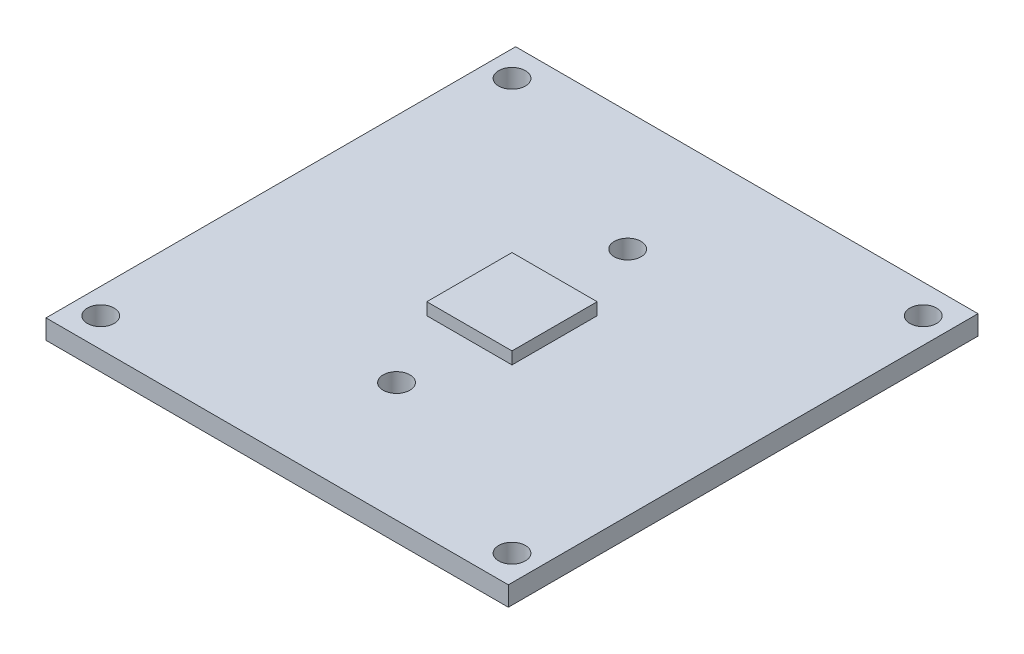
ISO-10303-21;
HEADER;
FILE_DESCRIPTION(('STEP AP214'),'2;1');
FILE_NAME('part.step','',(''),(''),'','','');
FILE_SCHEMA(('AUTOMOTIVE_DESIGN { 1 0 10303 214 1 1 1 1 }'));
ENDSEC;
DATA;
#1=APPLICATION_CONTEXT('core data for automotive mechanical design processes');
#2=APPLICATION_PROTOCOL_DEFINITION('international standard','automotive_design',2000,#1);
#3=PRODUCT_CONTEXT('',#1,'mechanical');
#4=PRODUCT('Part','Part','',(#3));
#5=PRODUCT_RELATED_PRODUCT_CATEGORY('part','',(#4));
#6=PRODUCT_DEFINITION_FORMATION('','',#4);
#7=PRODUCT_DEFINITION_CONTEXT('part definition',#1,'design');
#8=PRODUCT_DEFINITION('design','',#6,#7);
#9=PRODUCT_DEFINITION_SHAPE('','',#8);
#10=(LENGTH_UNIT() NAMED_UNIT(*) SI_UNIT(.MILLI.,.METRE.));
#11=(NAMED_UNIT(*) PLANE_ANGLE_UNIT() SI_UNIT($,.RADIAN.));
#12=(NAMED_UNIT(*) SI_UNIT($,.STERADIAN.) SOLID_ANGLE_UNIT());
#13=UNCERTAINTY_MEASURE_WITH_UNIT(LENGTH_MEASURE(1.E-05),#10,'distance_accuracy_value','');
#14=(GEOMETRIC_REPRESENTATION_CONTEXT(3) GLOBAL_UNCERTAINTY_ASSIGNED_CONTEXT((#13)) GLOBAL_UNIT_ASSIGNED_CONTEXT((#10,
#11,#12)) REPRESENTATION_CONTEXT('',''));
#15=CARTESIAN_POINT('',(0.,0.,0.));
#16=DIRECTION('',(0.,0.,1.));
#17=DIRECTION('',(1.,0.,0.));
#18=AXIS2_PLACEMENT_3D('',#15,#16,#17);
#19=CARTESIAN_POINT('',(0.,1.6,0.));
#20=DIRECTION('',(0.,1.,0.));
#21=DIRECTION('',(0.,0.,1.));
#22=AXIS2_PLACEMENT_3D('',#19,#20,#21);
#23=PLANE('',#22);
#24=CARTESIAN_POINT('',(16.9,1.6,-16.9));
#25=DIRECTION('',(0.,1.,0.));
#26=DIRECTION('',(0.,0.,1.));
#27=AXIS2_PLACEMENT_3D('',#24,#25,#26);
#28=CIRCLE('',#27,1.1);
#29=CARTESIAN_POINT('',(16.9,1.6,-15.8));
#30=VERTEX_POINT('',#29);
#31=EDGE_CURVE('E193',#30,#30,#28,.F.);
#32=ORIENTED_EDGE('',*,*,#31,.T.);
#33=EDGE_LOOP('',(#32));
#34=FACE_BOUND('',#33,.T.);
#35=CARTESIAN_POINT('',(-16.9,1.6,-16.9));
#36=DIRECTION('',(0.,1.,0.));
#37=DIRECTION('',(0.,0.,1.));
#38=AXIS2_PLACEMENT_3D('',#35,#36,#37);
#39=CIRCLE('',#38,1.1);
#40=CARTESIAN_POINT('',(-16.9,1.6,-15.8));
#41=VERTEX_POINT('',#40);
#42=EDGE_CURVE('E196',#41,#41,#39,.T.);
#43=ORIENTED_EDGE('',*,*,#42,.F.);
#44=EDGE_LOOP('',(#43));
#45=FACE_BOUND('',#44,.T.);
#46=DIRECTION('',(1.,0.,0.));
#47=VECTOR('',#46,1.);
#48=CARTESIAN_POINT('',(0.,1.6,19.3));
#49=LINE('',#48,#47);
#50=CARTESIAN_POINT('',(-19.,1.6,19.3));
#51=VERTEX_POINT('',#50);
#52=CARTESIAN_POINT('',(19.,1.6,19.3));
#53=VERTEX_POINT('',#52);
#54=EDGE_CURVE('E200',#51,#53,#49,.T.);
#55=ORIENTED_EDGE('',*,*,#54,.T.);
#56=DIRECTION('',(0.,0.,-1.));
#57=VECTOR('',#56,1.);
#58=CARTESIAN_POINT('',(19.,1.6,0.));
#59=LINE('',#58,#57);
#60=CARTESIAN_POINT('',(19.,1.6,-19.3));
#61=VERTEX_POINT('',#60);
#62=EDGE_CURVE('E203',#53,#61,#59,.T.);
#63=ORIENTED_EDGE('',*,*,#62,.T.);
#64=DIRECTION('',(1.,0.,0.));
#65=VECTOR('',#64,1.);
#66=CARTESIAN_POINT('',(0.,1.6,-19.3));
#67=LINE('',#66,#65);
#68=CARTESIAN_POINT('',(-19.,1.6,-19.3));
#69=VERTEX_POINT('',#68);
#70=EDGE_CURVE('E205',#69,#61,#67,.T.);
#71=ORIENTED_EDGE('',*,*,#70,.F.);
#72=DIRECTION('',(0.,0.,-1.));
#73=VECTOR('',#72,1.);
#74=CARTESIAN_POINT('',(-19.,1.6,0.));
#75=LINE('',#74,#73);
#76=EDGE_CURVE('E208',#51,#69,#75,.T.);
#77=ORIENTED_EDGE('',*,*,#76,.F.);
#78=EDGE_LOOP('',(#55,#63,#71,#77));
#79=FACE_BOUND('',#78,.T.);
#80=CARTESIAN_POINT('',(16.9,1.6,16.9));
#81=DIRECTION('',(0.,1.,0.));
#82=DIRECTION('',(0.,0.,1.));
#83=AXIS2_PLACEMENT_3D('',#80,#81,#82);
#84=CIRCLE('',#83,1.1);
#85=CARTESIAN_POINT('',(16.9,1.6,18.));
#86=VERTEX_POINT('',#85);
#87=EDGE_CURVE('E211',#86,#86,#84,.T.);
#88=ORIENTED_EDGE('',*,*,#87,.F.);
#89=EDGE_LOOP('',(#88));
#90=FACE_BOUND('',#89,.T.);
#91=CARTESIAN_POINT('',(-16.9,1.6,16.9));
#92=DIRECTION('',(0.,1.,0.));
#93=DIRECTION('',(0.,0.,1.));
#94=AXIS2_PLACEMENT_3D('',#91,#92,#93);
#95=CIRCLE('',#94,1.1);
#96=CARTESIAN_POINT('',(-16.9,1.6,18.));
#97=VERTEX_POINT('',#96);
#98=EDGE_CURVE('E214',#97,#97,#95,.F.);
#99=ORIENTED_EDGE('',*,*,#98,.T.);
#100=EDGE_LOOP('',(#99));
#101=FACE_BOUND('',#100,.T.);
#102=CARTESIAN_POINT('',(0.00814078074622268,1.6,-9.5));
#103=DIRECTION('',(0.,1.,0.));
#104=DIRECTION('',(0.,0.,1.));
#105=AXIS2_PLACEMENT_3D('',#102,#103,#104);
#106=CIRCLE('',#105,1.1);
#107=CARTESIAN_POINT('',(0.00814078074622268,1.6,-8.4));
#108=VERTEX_POINT('',#107);
#109=EDGE_CURVE('E217',#108,#108,#106,.T.);
#110=ORIENTED_EDGE('',*,*,#109,.F.);
#111=EDGE_LOOP('',(#110));
#112=FACE_BOUND('',#111,.T.);
#113=CARTESIAN_POINT('',(0.00814078074622268,1.6,9.5));
#114=DIRECTION('',(0.,1.,0.));
#115=DIRECTION('',(0.,0.,1.));
#116=AXIS2_PLACEMENT_3D('',#113,#114,#115);
#117=CIRCLE('',#116,1.1);
#118=CARTESIAN_POINT('',(0.00814078074622268,1.6,10.6));
#119=VERTEX_POINT('',#118);
#120=EDGE_CURVE('E220',#119,#119,#117,.F.);
#121=ORIENTED_EDGE('',*,*,#120,.T.);
#122=EDGE_LOOP('',(#121));
#123=FACE_BOUND('',#122,.T.);
#124=DIRECTION('',(-1.,0.,0.));
#125=VECTOR('',#124,1.);
#126=CARTESIAN_POINT('',(-3.5,1.6,-3.5));
#127=LINE('',#126,#125);
#128=CARTESIAN_POINT('',(3.5,1.6,-3.5));
#129=VERTEX_POINT('',#128);
#130=CARTESIAN_POINT('',(-3.5,1.6,-3.5));
#131=VERTEX_POINT('',#130);
#132=EDGE_CURVE('E564',#129,#131,#127,.T.);
#133=ORIENTED_EDGE('',*,*,#132,.F.);
#134=DIRECTION('',(0.,0.,-1.));
#135=VECTOR('',#134,1.);
#136=CARTESIAN_POINT('',(3.5,1.6,3.5));
#137=LINE('',#136,#135);
#138=CARTESIAN_POINT('',(3.5,1.6,3.5));
#139=VERTEX_POINT('',#138);
#140=EDGE_CURVE('E151',#139,#129,#137,.T.);
#141=ORIENTED_EDGE('',*,*,#140,.F.);
#142=DIRECTION('',(1.,0.,0.));
#143=VECTOR('',#142,1.);
#144=CARTESIAN_POINT('',(-3.5,1.6,3.5));
#145=LINE('',#144,#143);
#146=CARTESIAN_POINT('',(-3.5,1.6,3.5));
#147=VERTEX_POINT('',#146);
#148=EDGE_CURVE('E147',#147,#139,#145,.T.);
#149=ORIENTED_EDGE('',*,*,#148,.F.);
#150=DIRECTION('',(0.,0.,1.));
#151=VECTOR('',#150,1.);
#152=CARTESIAN_POINT('',(-3.5,1.6,3.5));
#153=LINE('',#152,#151);
#154=EDGE_CURVE('E566',#131,#147,#153,.T.);
#155=ORIENTED_EDGE('',*,*,#154,.F.);
#156=EDGE_LOOP('',(#133,#141,#149,#155));
#157=FACE_BOUND('',#156,.T.);
#158=ADVANCED_FACE('F38',(#34,#45,#79,#90,#101,#112,#123,#157),#23,.T.);
#159=CARTESIAN_POINT('',(0.,0.,0.));
#160=DIRECTION('',(0.,1.,0.));
#161=DIRECTION('',(0.,0.,1.));
#162=AXIS2_PLACEMENT_3D('',#159,#160,#161);
#163=PLANE('',#162);
#164=CARTESIAN_POINT('',(0.00814078074622268,0.,9.5));
#165=DIRECTION('',(0.,1.,0.));
#166=DIRECTION('',(0.,0.,1.));
#167=AXIS2_PLACEMENT_3D('',#164,#165,#166);
#168=CIRCLE('',#167,1.1);
#169=CARTESIAN_POINT('',(0.00814078074622268,0.,10.6));
#170=VERTEX_POINT('',#169);
#171=EDGE_CURVE('E197',#170,#170,#168,.F.);
#172=ORIENTED_EDGE('',*,*,#171,.F.);
#173=EDGE_LOOP('',(#172));
#174=FACE_BOUND('',#173,.T.);
#175=CARTESIAN_POINT('',(0.00814078074622268,0.,9.5));
#176=DIRECTION('',(0.,1.,0.));
#177=DIRECTION('',(0.,0.,1.));
#178=AXIS2_PLACEMENT_3D('',#175,#176,#177);
#179=CIRCLE('',#178,2.);
#180=CARTESIAN_POINT('',(0.00814078074622268,0.,11.5));
#181=VERTEX_POINT('',#180);
#182=EDGE_CURVE('E11',#181,#181,#179,.T.);
#183=ORIENTED_EDGE('',*,*,#182,.F.);
#184=EDGE_LOOP('',(#183));
#185=FACE_BOUND('',#184,.T.);
#186=ADVANCED_FACE('F267',(#174,#185),#163,.F.);
#187=CARTESIAN_POINT('',(0.00814078074622268,0.,-9.5));
#188=DIRECTION('',(0.,1.,0.));
#189=DIRECTION('',(0.,0.,1.));
#190=AXIS2_PLACEMENT_3D('',#187,#188,#189);
#191=CIRCLE('',#190,1.1);
#192=CARTESIAN_POINT('',(0.00814078074622268,0.,-8.4));
#193=VERTEX_POINT('',#192);
#194=EDGE_CURVE('E247',#193,#193,#191,.T.);
#195=ORIENTED_EDGE('',*,*,#194,.T.);
#196=EDGE_LOOP('',(#195));
#197=FACE_BOUND('',#196,.T.);
#198=CARTESIAN_POINT('',(0.00814078074622268,0.,-9.5));
#199=DIRECTION('',(0.,1.,0.));
#200=DIRECTION('',(0.,0.,1.));
#201=AXIS2_PLACEMENT_3D('',#198,#199,#200);
#202=CIRCLE('',#201,2.);
#203=CARTESIAN_POINT('',(0.00814078074622268,0.,-7.5));
#204=VERTEX_POINT('',#203);
#205=EDGE_CURVE('E46',#204,#204,#202,.T.);
#206=ORIENTED_EDGE('',*,*,#205,.F.);
#207=EDGE_LOOP('',(#206));
#208=FACE_BOUND('',#207,.T.);
#209=ADVANCED_FACE('F264',(#197,#208),#163,.F.);
#210=CARTESIAN_POINT('',(0.,1.6,19.3));
#211=DIRECTION('',(0.,0.,-1.));
#212=DIRECTION('',(-1.,0.,0.));
#213=AXIS2_PLACEMENT_3D('',#210,#211,#212);
#214=PLANE('',#213);
#215=DIRECTION('',(1.,0.,0.));
#216=VECTOR('',#215,1.);
#217=CARTESIAN_POINT('',(0.,0.,19.3));
#218=LINE('',#217,#216);
#219=CARTESIAN_POINT('',(-19.,0.,19.3));
#220=VERTEX_POINT('',#219);
#221=CARTESIAN_POINT('',(19.,0.,19.3));
#222=VERTEX_POINT('',#221);
#223=EDGE_CURVE('E229',#220,#222,#218,.T.);
#224=ORIENTED_EDGE('',*,*,#223,.T.);
#225=DIRECTION('',(0.,-1.,0.));
#226=VECTOR('',#225,1.);
#227=CARTESIAN_POINT('',(19.,1.6,19.3));
#228=LINE('',#227,#226);
#229=EDGE_CURVE('E257',#53,#222,#228,.T.);
#230=ORIENTED_EDGE('',*,*,#229,.F.);
#231=ORIENTED_EDGE('',*,*,#54,.F.);
#232=DIRECTION('',(0.,-1.,0.));
#233=VECTOR('',#232,1.);
#234=CARTESIAN_POINT('',(-19.,1.6,19.3));
#235=LINE('',#234,#233);
#236=EDGE_CURVE('E223',#51,#220,#235,.T.);
#237=ORIENTED_EDGE('',*,*,#236,.T.);
#238=EDGE_LOOP('',(#224,#230,#231,#237));
#239=FACE_BOUND('',#238,.T.);
#240=ADVANCED_FACE('F266',(#239),#214,.F.);
#241=CARTESIAN_POINT('',(19.,1.6,0.));
#242=DIRECTION('',(-1.,0.,0.));
#243=DIRECTION('',(0.,0.,1.));
#244=AXIS2_PLACEMENT_3D('',#241,#242,#243);
#245=PLANE('',#244);
#246=DIRECTION('',(0.,0.,-1.));
#247=VECTOR('',#246,1.);
#248=CARTESIAN_POINT('',(19.,0.,0.));
#249=LINE('',#248,#247);
#250=CARTESIAN_POINT('',(19.,0.,-19.3));
#251=VERTEX_POINT('',#250);
#252=EDGE_CURVE('E232',#222,#251,#249,.T.);
#253=ORIENTED_EDGE('',*,*,#252,.T.);
#254=DIRECTION('',(0.,-1.,0.));
#255=VECTOR('',#254,1.);
#256=CARTESIAN_POINT('',(19.,1.6,-19.3));
#257=LINE('',#256,#255);
#258=EDGE_CURVE('E255',#61,#251,#257,.T.);
#259=ORIENTED_EDGE('',*,*,#258,.F.);
#260=ORIENTED_EDGE('',*,*,#62,.F.);
#261=ORIENTED_EDGE('',*,*,#229,.T.);
#262=EDGE_LOOP('',(#253,#259,#260,#261));
#263=FACE_BOUND('',#262,.T.);
#264=ADVANCED_FACE('F275',(#263),#245,.F.);
#265=CARTESIAN_POINT('',(0.,1.6,-19.3));
#266=DIRECTION('',(0.,0.,-1.));
#267=DIRECTION('',(-1.,0.,0.));
#268=AXIS2_PLACEMENT_3D('',#265,#266,#267);
#269=PLANE('',#268);
#270=DIRECTION('',(1.,0.,0.));
#271=VECTOR('',#270,1.);
#272=CARTESIAN_POINT('',(0.,0.,-19.3));
#273=LINE('',#272,#271);
#274=CARTESIAN_POINT('',(-19.,0.,-19.3));
#275=VERTEX_POINT('',#274);
#276=EDGE_CURVE('E235',#275,#251,#273,.T.);
#277=ORIENTED_EDGE('',*,*,#276,.F.);
#278=DIRECTION('',(0.,-1.,0.));
#279=VECTOR('',#278,1.);
#280=CARTESIAN_POINT('',(-19.,1.6,-19.3));
#281=LINE('',#280,#279);
#282=EDGE_CURVE('E253',#69,#275,#281,.T.);
#283=ORIENTED_EDGE('',*,*,#282,.F.);
#284=ORIENTED_EDGE('',*,*,#70,.T.);
#285=ORIENTED_EDGE('',*,*,#258,.T.);
#286=EDGE_LOOP('',(#277,#283,#284,#285));
#287=FACE_BOUND('',#286,.T.);
#288=ADVANCED_FACE('F429',(#287),#269,.T.);
#289=CARTESIAN_POINT('',(0.00814078074622268,1.6,-9.5));
#290=DIRECTION('',(0.,-1.,0.));
#291=DIRECTION('',(0.,0.,-1.));
#292=AXIS2_PLACEMENT_3D('',#289,#290,#291);
#293=CYLINDRICAL_SURFACE('',#292,1.1);
#294=ORIENTED_EDGE('',*,*,#109,.T.);
#295=EDGE_LOOP('',(#294));
#296=FACE_BOUND('',#295,.T.);
#297=ORIENTED_EDGE('',*,*,#194,.F.);
#298=EDGE_LOOP('',(#297));
#299=FACE_BOUND('',#298,.T.);
#300=ADVANCED_FACE('F421',(#296,#299),#293,.F.);
#301=CARTESIAN_POINT('',(-16.9,1.6,16.9));
#302=DIRECTION('',(0.,-1.,0.));
#303=DIRECTION('',(0.,0.,-1.));
#304=AXIS2_PLACEMENT_3D('',#301,#302,#303);
#305=CYLINDRICAL_SURFACE('',#304,1.1);
#306=ORIENTED_EDGE('',*,*,#98,.F.);
#307=EDGE_LOOP('',(#306));
#308=FACE_BOUND('',#307,.T.);
#309=CARTESIAN_POINT('',(-16.9,0.,16.9));
#310=DIRECTION('',(0.,1.,0.));
#311=DIRECTION('',(0.,0.,1.));
#312=AXIS2_PLACEMENT_3D('',#309,#310,#311);
#313=CIRCLE('',#312,1.1);
#314=CARTESIAN_POINT('',(-16.9,0.,18.));
#315=VERTEX_POINT('',#314);
#316=EDGE_CURVE('E244',#315,#315,#313,.F.);
#317=ORIENTED_EDGE('',*,*,#316,.T.);
#318=EDGE_LOOP('',(#317));
#319=FACE_BOUND('',#318,.T.);
#320=ADVANCED_FACE('F413',(#308,#319),#305,.F.);
#321=CARTESIAN_POINT('',(16.9,1.6,16.9));
#322=DIRECTION('',(0.,-1.,0.));
#323=DIRECTION('',(0.,0.,-1.));
#324=AXIS2_PLACEMENT_3D('',#321,#322,#323);
#325=CYLINDRICAL_SURFACE('',#324,1.1);
#326=ORIENTED_EDGE('',*,*,#87,.T.);
#327=EDGE_LOOP('',(#326));
#328=FACE_BOUND('',#327,.T.);
#329=CARTESIAN_POINT('',(16.9,0.,16.9));
#330=DIRECTION('',(0.,1.,0.));
#331=DIRECTION('',(0.,0.,1.));
#332=AXIS2_PLACEMENT_3D('',#329,#330,#331);
#333=CIRCLE('',#332,1.1);
#334=CARTESIAN_POINT('',(16.9,0.,18.));
#335=VERTEX_POINT('',#334);
#336=EDGE_CURVE('E241',#335,#335,#333,.T.);
#337=ORIENTED_EDGE('',*,*,#336,.F.);
#338=EDGE_LOOP('',(#337));
#339=FACE_BOUND('',#338,.T.);
#340=ADVANCED_FACE('F405',(#328,#339),#325,.F.);
#341=CARTESIAN_POINT('',(-19.,1.6,0.));
#342=DIRECTION('',(-1.,0.,0.));
#343=DIRECTION('',(0.,0.,1.));
#344=AXIS2_PLACEMENT_3D('',#341,#342,#343);
#345=PLANE('',#344);
#346=DIRECTION('',(0.,0.,-1.));
#347=VECTOR('',#346,1.);
#348=CARTESIAN_POINT('',(-19.,0.,0.));
#349=LINE('',#348,#347);
#350=EDGE_CURVE('E238',#220,#275,#349,.T.);
#351=ORIENTED_EDGE('',*,*,#350,.F.);
#352=ORIENTED_EDGE('',*,*,#236,.F.);
#353=ORIENTED_EDGE('',*,*,#76,.T.);
#354=ORIENTED_EDGE('',*,*,#282,.T.);
#355=EDGE_LOOP('',(#351,#352,#353,#354));
#356=FACE_BOUND('',#355,.T.);
#357=ADVANCED_FACE('F398',(#356),#345,.T.);
#358=CARTESIAN_POINT('',(-16.9,1.6,-16.9));
#359=DIRECTION('',(0.,-1.,0.));
#360=DIRECTION('',(0.,0.,-1.));
#361=AXIS2_PLACEMENT_3D('',#358,#359,#360);
#362=CYLINDRICAL_SURFACE('',#361,1.1);
#363=ORIENTED_EDGE('',*,*,#42,.T.);
#364=EDGE_LOOP('',(#363));
#365=FACE_BOUND('',#364,.T.);
#366=CARTESIAN_POINT('',(-16.9,0.,-16.9));
#367=DIRECTION('',(0.,1.,0.));
#368=DIRECTION('',(0.,0.,1.));
#369=AXIS2_PLACEMENT_3D('',#366,#367,#368);
#370=CIRCLE('',#369,1.1);
#371=CARTESIAN_POINT('',(-16.9,0.,-15.8));
#372=VERTEX_POINT('',#371);
#373=EDGE_CURVE('E226',#372,#372,#370,.T.);
#374=ORIENTED_EDGE('',*,*,#373,.F.);
#375=EDGE_LOOP('',(#374));
#376=FACE_BOUND('',#375,.T.);
#377=ADVANCED_FACE('F391',(#365,#376),#362,.F.);
#378=CARTESIAN_POINT('',(16.9,1.6,-16.9));
#379=DIRECTION('',(0.,-1.,0.));
#380=DIRECTION('',(0.,0.,-1.));
#381=AXIS2_PLACEMENT_3D('',#378,#379,#380);
#382=CYLINDRICAL_SURFACE('',#381,1.1);
#383=ORIENTED_EDGE('',*,*,#31,.F.);
#384=EDGE_LOOP('',(#383));
#385=FACE_BOUND('',#384,.T.);
#386=CARTESIAN_POINT('',(16.9,0.,-16.9));
#387=DIRECTION('',(0.,1.,0.));
#388=DIRECTION('',(0.,0.,1.));
#389=AXIS2_PLACEMENT_3D('',#386,#387,#388);
#390=CIRCLE('',#389,1.1);
#391=CARTESIAN_POINT('',(16.9,0.,-15.8));
#392=VERTEX_POINT('',#391);
#393=EDGE_CURVE('E187',#392,#392,#390,.F.);
#394=ORIENTED_EDGE('',*,*,#393,.T.);
#395=EDGE_LOOP('',(#394));
#396=FACE_BOUND('',#395,.T.);
#397=ADVANCED_FACE('F40',(#385,#396),#382,.F.);
#398=CARTESIAN_POINT('',(0.00814078074622268,1.6,9.5));
#399=DIRECTION('',(0.,-1.,0.));
#400=DIRECTION('',(0.,0.,-1.));
#401=AXIS2_PLACEMENT_3D('',#398,#399,#400);
#402=CYLINDRICAL_SURFACE('',#401,1.1);
#403=ORIENTED_EDGE('',*,*,#120,.F.);
#404=EDGE_LOOP('',(#403));
#405=FACE_BOUND('',#404,.T.);
#406=ORIENTED_EDGE('',*,*,#171,.T.);
#407=EDGE_LOOP('',(#406));
#408=FACE_BOUND('',#407,.T.);
#409=ADVANCED_FACE('F283',(#405,#408),#402,.F.);
#410=DIRECTION('',(0.,0.,-1.));
#411=VECTOR('',#410,1.);
#412=CARTESIAN_POINT('',(-16.,0.,0.));
#413=LINE('',#412,#411);
#414=CARTESIAN_POINT('',(-16.,0.,14.3));
#415=VERTEX_POINT('',#414);
#416=CARTESIAN_POINT('',(-16.,0.,-14.3));
#417=VERTEX_POINT('',#416);
#418=EDGE_CURVE('E165',#415,#417,#413,.T.);
#419=ORIENTED_EDGE('',*,*,#418,.F.);
#420=DIRECTION('',(1.,0.,0.));
#421=VECTOR('',#420,1.);
#422=CARTESIAN_POINT('',(0.,0.,14.3));
#423=LINE('',#422,#421);
#424=CARTESIAN_POINT('',(16.,0.,14.3));
#425=VERTEX_POINT('',#424);
#426=EDGE_CURVE('E153',#415,#425,#423,.T.);
#427=ORIENTED_EDGE('',*,*,#426,.T.);
#428=DIRECTION('',(0.,0.,-1.));
#429=VECTOR('',#428,1.);
#430=CARTESIAN_POINT('',(16.,0.,0.));
#431=LINE('',#430,#429);
#432=CARTESIAN_POINT('',(16.,0.,-14.3));
#433=VERTEX_POINT('',#432);
#434=EDGE_CURVE('E156',#425,#433,#431,.T.);
#435=ORIENTED_EDGE('',*,*,#434,.T.);
#436=DIRECTION('',(1.,0.,0.));
#437=VECTOR('',#436,1.);
#438=CARTESIAN_POINT('',(0.,0.,-14.3));
#439=LINE('',#438,#437);
#440=EDGE_CURVE('E61',#417,#433,#439,.T.);
#441=ORIENTED_EDGE('',*,*,#440,.F.);
#442=EDGE_LOOP('',(#419,#427,#435,#441));
#443=FACE_BOUND('',#442,.T.);
#444=ORIENTED_EDGE('',*,*,#393,.F.);
#445=EDGE_LOOP('',(#444));
#446=FACE_BOUND('',#445,.T.);
#447=ORIENTED_EDGE('',*,*,#373,.T.);
#448=EDGE_LOOP('',(#447));
#449=FACE_BOUND('',#448,.T.);
#450=ORIENTED_EDGE('',*,*,#223,.F.);
#451=ORIENTED_EDGE('',*,*,#350,.T.);
#452=ORIENTED_EDGE('',*,*,#276,.T.);
#453=ORIENTED_EDGE('',*,*,#252,.F.);
#454=EDGE_LOOP('',(#450,#451,#452,#453));
#455=FACE_BOUND('',#454,.T.);
#456=ORIENTED_EDGE('',*,*,#336,.T.);
#457=EDGE_LOOP('',(#456));
#458=FACE_BOUND('',#457,.T.);
#459=ORIENTED_EDGE('',*,*,#316,.F.);
#460=EDGE_LOOP('',(#459));
#461=FACE_BOUND('',#460,.T.);
#462=ADVANCED_FACE('F270',(#443,#446,#449,#455,#458,#461),#163,.F.);
#463=CARTESIAN_POINT('',(0.,-2.3,14.3));
#464=DIRECTION('',(0.,0.,1.));
#465=DIRECTION('',(1.,0.,0.));
#466=AXIS2_PLACEMENT_3D('',#463,#464,#465);
#467=PLANE('',#466);
#468=ORIENTED_EDGE('',*,*,#426,.F.);
#469=DIRECTION('',(0.,1.,0.));
#470=VECTOR('',#469,1.);
#471=CARTESIAN_POINT('',(-16.,-2.3,14.3));
#472=LINE('',#471,#470);
#473=CARTESIAN_POINT('',(-16.,-2.3,14.3));
#474=VERTEX_POINT('',#473);
#475=EDGE_CURVE('E185',#474,#415,#472,.T.);
#476=ORIENTED_EDGE('',*,*,#475,.F.);
#477=DIRECTION('',(1.,0.,0.));
#478=VECTOR('',#477,1.);
#479=CARTESIAN_POINT('',(0.,-2.3,14.3));
#480=LINE('',#479,#478);
#481=CARTESIAN_POINT('',(16.,-2.3,14.3));
#482=VERTEX_POINT('',#481);
#483=EDGE_CURVE('E168',#474,#482,#480,.T.);
#484=ORIENTED_EDGE('',*,*,#483,.T.);
#485=DIRECTION('',(0.,1.,0.));
#486=VECTOR('',#485,1.);
#487=CARTESIAN_POINT('',(16.,-2.3,14.3));
#488=LINE('',#487,#486);
#489=EDGE_CURVE('E178',#482,#425,#488,.T.);
#490=ORIENTED_EDGE('',*,*,#489,.T.);
#491=EDGE_LOOP('',(#468,#476,#484,#490));
#492=FACE_BOUND('',#491,.T.);
#493=ADVANCED_FACE('F282',(#492),#467,.T.);
#494=CARTESIAN_POINT('',(-16.,-2.3,0.));
#495=DIRECTION('',(1.,0.,0.));
#496=DIRECTION('',(0.,0.,-1.));
#497=AXIS2_PLACEMENT_3D('',#494,#495,#496);
#498=PLANE('',#497);
#499=ORIENTED_EDGE('',*,*,#418,.T.);
#500=DIRECTION('',(0.,1.,0.));
#501=VECTOR('',#500,1.);
#502=CARTESIAN_POINT('',(-16.,-2.3,-14.3));
#503=LINE('',#502,#501);
#504=CARTESIAN_POINT('',(-16.,-2.3,-14.3));
#505=VERTEX_POINT('',#504);
#506=EDGE_CURVE('E188',#505,#417,#503,.T.);
#507=ORIENTED_EDGE('',*,*,#506,.F.);
#508=DIRECTION('',(0.,0.,-1.));
#509=VECTOR('',#508,1.);
#510=CARTESIAN_POINT('',(-16.,-2.3,0.));
#511=LINE('',#510,#509);
#512=EDGE_CURVE('E176',#474,#505,#511,.T.);
#513=ORIENTED_EDGE('',*,*,#512,.F.);
#514=ORIENTED_EDGE('',*,*,#475,.T.);
#515=EDGE_LOOP('',(#499,#507,#513,#514));
#516=FACE_BOUND('',#515,.T.);
#517=ADVANCED_FACE('F302',(#516),#498,.F.);
#518=CARTESIAN_POINT('',(0.,-2.3,-14.3));
#519=DIRECTION('',(0.,0.,1.));
#520=DIRECTION('',(1.,0.,0.));
#521=AXIS2_PLACEMENT_3D('',#518,#519,#520);
#522=PLANE('',#521);
#523=ORIENTED_EDGE('',*,*,#440,.T.);
#524=DIRECTION('',(0.,1.,0.));
#525=VECTOR('',#524,1.);
#526=CARTESIAN_POINT('',(16.,-2.3,-14.3));
#527=LINE('',#526,#525);
#528=CARTESIAN_POINT('',(16.,-2.3,-14.3));
#529=VERTEX_POINT('',#528);
#530=EDGE_CURVE('E190',#529,#433,#527,.T.);
#531=ORIENTED_EDGE('',*,*,#530,.F.);
#532=DIRECTION('',(1.,0.,0.));
#533=VECTOR('',#532,1.);
#534=CARTESIAN_POINT('',(0.,-2.3,-14.3));
#535=LINE('',#534,#533);
#536=EDGE_CURVE('E174',#505,#529,#535,.T.);
#537=ORIENTED_EDGE('',*,*,#536,.F.);
#538=ORIENTED_EDGE('',*,*,#506,.T.);
#539=EDGE_LOOP('',(#523,#531,#537,#538));
#540=FACE_BOUND('',#539,.T.);
#541=ADVANCED_FACE('F298',(#540),#522,.F.);
#542=CARTESIAN_POINT('',(0.00814078074622268,-2.3,9.5));
#543=DIRECTION('',(0.,1.,0.));
#544=DIRECTION('',(0.,0.,1.));
#545=AXIS2_PLACEMENT_3D('',#542,#543,#544);
#546=CYLINDRICAL_SURFACE('',#545,2.);
#547=CARTESIAN_POINT('',(0.00814078074622268,-2.3,9.5));
#548=DIRECTION('',(0.,1.,0.));
#549=DIRECTION('',(0.,0.,1.));
#550=AXIS2_PLACEMENT_3D('',#547,#548,#549);
#551=CIRCLE('',#550,2.);
#552=CARTESIAN_POINT('',(0.00814078074622268,-2.3,11.5));
#553=VERTEX_POINT('',#552);
#554=EDGE_CURVE('E164',#553,#553,#551,.T.);
#555=ORIENTED_EDGE('',*,*,#554,.F.);
#556=EDGE_LOOP('',(#555));
#557=FACE_BOUND('',#556,.T.);
#558=ORIENTED_EDGE('',*,*,#182,.T.);
#559=EDGE_LOOP('',(#558));
#560=FACE_BOUND('',#559,.T.);
#561=ADVANCED_FACE('F294',(#557,#560),#546,.F.);
#562=CARTESIAN_POINT('',(0.00814078074622268,-2.3,-9.5));
#563=DIRECTION('',(0.,1.,0.));
#564=DIRECTION('',(0.,0.,1.));
#565=AXIS2_PLACEMENT_3D('',#562,#563,#564);
#566=CYLINDRICAL_SURFACE('',#565,2.);
#567=CARTESIAN_POINT('',(0.00814078074622268,-2.3,-9.5));
#568=DIRECTION('',(0.,1.,0.));
#569=DIRECTION('',(0.,0.,1.));
#570=AXIS2_PLACEMENT_3D('',#567,#568,#569);
#571=CIRCLE('',#570,2.);
#572=CARTESIAN_POINT('',(0.00814078074622268,-2.3,-7.5));
#573=VERTEX_POINT('',#572);
#574=EDGE_CURVE('E161',#573,#573,#571,.T.);
#575=ORIENTED_EDGE('',*,*,#574,.F.);
#576=EDGE_LOOP('',(#575));
#577=FACE_BOUND('',#576,.T.);
#578=ORIENTED_EDGE('',*,*,#205,.T.);
#579=EDGE_LOOP('',(#578));
#580=FACE_BOUND('',#579,.T.);
#581=ADVANCED_FACE('F262',(#577,#580),#566,.F.);
#582=CARTESIAN_POINT('',(16.,-2.3,0.));
#583=DIRECTION('',(1.,0.,0.));
#584=DIRECTION('',(0.,0.,-1.));
#585=AXIS2_PLACEMENT_3D('',#582,#583,#584);
#586=PLANE('',#585);
#587=ORIENTED_EDGE('',*,*,#434,.F.);
#588=ORIENTED_EDGE('',*,*,#489,.F.);
#589=DIRECTION('',(0.,0.,-1.));
#590=VECTOR('',#589,1.);
#591=CARTESIAN_POINT('',(16.,-2.3,0.));
#592=LINE('',#591,#590);
#593=EDGE_CURVE('E171',#482,#529,#592,.T.);
#594=ORIENTED_EDGE('',*,*,#593,.T.);
#595=ORIENTED_EDGE('',*,*,#530,.T.);
#596=EDGE_LOOP('',(#587,#588,#594,#595));
#597=FACE_BOUND('',#596,.T.);
#598=ADVANCED_FACE('F293',(#597),#586,.T.);
#599=CARTESIAN_POINT('',(0.,-2.3,0.));
#600=DIRECTION('',(0.,1.,0.));
#601=DIRECTION('',(0.,0.,1.));
#602=AXIS2_PLACEMENT_3D('',#599,#600,#601);
#603=PLANE('',#602);
#604=ORIENTED_EDGE('',*,*,#574,.T.);
#605=EDGE_LOOP('',(#604));
#606=FACE_BOUND('',#605,.T.);
#607=ORIENTED_EDGE('',*,*,#554,.T.);
#608=EDGE_LOOP('',(#607));
#609=FACE_BOUND('',#608,.T.);
#610=ORIENTED_EDGE('',*,*,#483,.F.);
#611=ORIENTED_EDGE('',*,*,#512,.T.);
#612=ORIENTED_EDGE('',*,*,#536,.T.);
#613=ORIENTED_EDGE('',*,*,#593,.F.);
#614=EDGE_LOOP('',(#610,#611,#612,#613));
#615=FACE_BOUND('',#614,.T.);
#616=ADVANCED_FACE('F306',(#606,#609,#615),#603,.F.);
#617=CARTESIAN_POINT('',(3.5,2.6,3.5));
#618=DIRECTION('',(-1.,0.,0.));
#619=DIRECTION('',(0.,0.,1.));
#620=AXIS2_PLACEMENT_3D('',#617,#618,#619);
#621=PLANE('',#620);
#622=ORIENTED_EDGE('',*,*,#140,.T.);
#623=DIRECTION('',(0.,-1.,0.));
#624=VECTOR('',#623,1.);
#625=CARTESIAN_POINT('',(3.5,2.6,-3.5));
#626=LINE('',#625,#624);
#627=CARTESIAN_POINT('',(3.5,2.6,-3.5));
#628=VERTEX_POINT('',#627);
#629=EDGE_CURVE('E132',#628,#129,#626,.T.);
#630=ORIENTED_EDGE('',*,*,#629,.F.);
#631=DIRECTION('',(0.,0.,-1.));
#632=VECTOR('',#631,1.);
#633=CARTESIAN_POINT('',(3.5,2.6,3.5));
#634=LINE('',#633,#632);
#635=CARTESIAN_POINT('',(3.5,2.6,3.5));
#636=VERTEX_POINT('',#635);
#637=EDGE_CURVE('E139',#636,#628,#634,.T.);
#638=ORIENTED_EDGE('',*,*,#637,.F.);
#639=DIRECTION('',(0.,-1.,0.));
#640=VECTOR('',#639,1.);
#641=CARTESIAN_POINT('',(3.5,2.6,3.5));
#642=LINE('',#641,#640);
#643=EDGE_CURVE('E573',#636,#139,#642,.T.);
#644=ORIENTED_EDGE('',*,*,#643,.T.);
#645=EDGE_LOOP('',(#622,#630,#638,#644));
#646=FACE_BOUND('',#645,.T.);
#647=ADVANCED_FACE('F149',(#646),#621,.F.);
#648=CARTESIAN_POINT('',(-3.5,2.6,-3.5));
#649=DIRECTION('',(0.,0.,1.));
#650=DIRECTION('',(1.,0.,0.));
#651=AXIS2_PLACEMENT_3D('',#648,#649,#650);
#652=PLANE('',#651);
#653=ORIENTED_EDGE('',*,*,#132,.T.);
#654=DIRECTION('',(0.,-1.,0.));
#655=VECTOR('',#654,1.);
#656=CARTESIAN_POINT('',(-3.5,2.6,-3.5));
#657=LINE('',#656,#655);
#658=CARTESIAN_POINT('',(-3.5,2.6,-3.5));
#659=VERTEX_POINT('',#658);
#660=EDGE_CURVE('E135',#659,#131,#657,.T.);
#661=ORIENTED_EDGE('',*,*,#660,.F.);
#662=DIRECTION('',(-1.,0.,0.));
#663=VECTOR('',#662,1.);
#664=CARTESIAN_POINT('',(-3.5,2.6,-3.5));
#665=LINE('',#664,#663);
#666=EDGE_CURVE('E128',#628,#659,#665,.T.);
#667=ORIENTED_EDGE('',*,*,#666,.F.);
#668=ORIENTED_EDGE('',*,*,#629,.T.);
#669=EDGE_LOOP('',(#653,#661,#667,#668));
#670=FACE_BOUND('',#669,.T.);
#671=ADVANCED_FACE('F130',(#670),#652,.F.);
#672=CARTESIAN_POINT('',(-3.5,2.6,3.5));
#673=DIRECTION('',(1.,0.,0.));
#674=DIRECTION('',(0.,0.,-1.));
#675=AXIS2_PLACEMENT_3D('',#672,#673,#674);
#676=PLANE('',#675);
#677=ORIENTED_EDGE('',*,*,#154,.T.);
#678=DIRECTION('',(0.,-1.,0.));
#679=VECTOR('',#678,1.);
#680=CARTESIAN_POINT('',(-3.5,2.6,3.5));
#681=LINE('',#680,#679);
#682=CARTESIAN_POINT('',(-3.5,2.6,3.5));
#683=VERTEX_POINT('',#682);
#684=EDGE_CURVE('E53',#683,#147,#681,.T.);
#685=ORIENTED_EDGE('',*,*,#684,.F.);
#686=DIRECTION('',(0.,0.,1.));
#687=VECTOR('',#686,1.);
#688=CARTESIAN_POINT('',(-3.5,2.6,3.5));
#689=LINE('',#688,#687);
#690=EDGE_CURVE('E138',#659,#683,#689,.T.);
#691=ORIENTED_EDGE('',*,*,#690,.F.);
#692=ORIENTED_EDGE('',*,*,#660,.T.);
#693=EDGE_LOOP('',(#677,#685,#691,#692));
#694=FACE_BOUND('',#693,.T.);
#695=ADVANCED_FACE('F320',(#694),#676,.F.);
#696=CARTESIAN_POINT('',(-3.5,2.6,3.5));
#697=DIRECTION('',(0.,0.,-1.));
#698=DIRECTION('',(-1.,0.,0.));
#699=AXIS2_PLACEMENT_3D('',#696,#697,#698);
#700=PLANE('',#699);
#701=ORIENTED_EDGE('',*,*,#148,.T.);
#702=ORIENTED_EDGE('',*,*,#643,.F.);
#703=DIRECTION('',(1.,0.,0.));
#704=VECTOR('',#703,1.);
#705=CARTESIAN_POINT('',(-3.5,2.6,3.5));
#706=LINE('',#705,#704);
#707=EDGE_CURVE('E143',#683,#636,#706,.T.);
#708=ORIENTED_EDGE('',*,*,#707,.F.);
#709=ORIENTED_EDGE('',*,*,#684,.T.);
#710=EDGE_LOOP('',(#701,#702,#708,#709));
#711=FACE_BOUND('',#710,.T.);
#712=ADVANCED_FACE('F323',(#711),#700,.F.);
#713=CARTESIAN_POINT('',(0.,2.6,0.));
#714=DIRECTION('',(0.,-1.,0.));
#715=DIRECTION('',(0.,0.,-1.));
#716=AXIS2_PLACEMENT_3D('',#713,#714,#715);
#717=PLANE('',#716);
#718=ORIENTED_EDGE('',*,*,#637,.T.);
#719=ORIENTED_EDGE('',*,*,#666,.T.);
#720=ORIENTED_EDGE('',*,*,#690,.T.);
#721=ORIENTED_EDGE('',*,*,#707,.T.);
#722=EDGE_LOOP('',(#718,#719,#720,#721));
#723=FACE_BOUND('',#722,.T.);
#724=ADVANCED_FACE('F142',(#723),#717,.F.);
#725=CLOSED_SHELL('',(#158,#186,#209,#240,#264,#288,#300,#320,#340,#357,#377,#397,#409,#462,
#493,#517,#541,#561,#581,#598,#616,#647,#671,#695,#712,#724));
#726=MANIFOLD_SOLID_BREP('B2',#725);
#727=ADVANCED_BREP_SHAPE_REPRESENTATION('',(#18,#726),#14);
#728=SHAPE_DEFINITION_REPRESENTATION(#9,#727);
ENDSEC;
END-ISO-10303-21;
